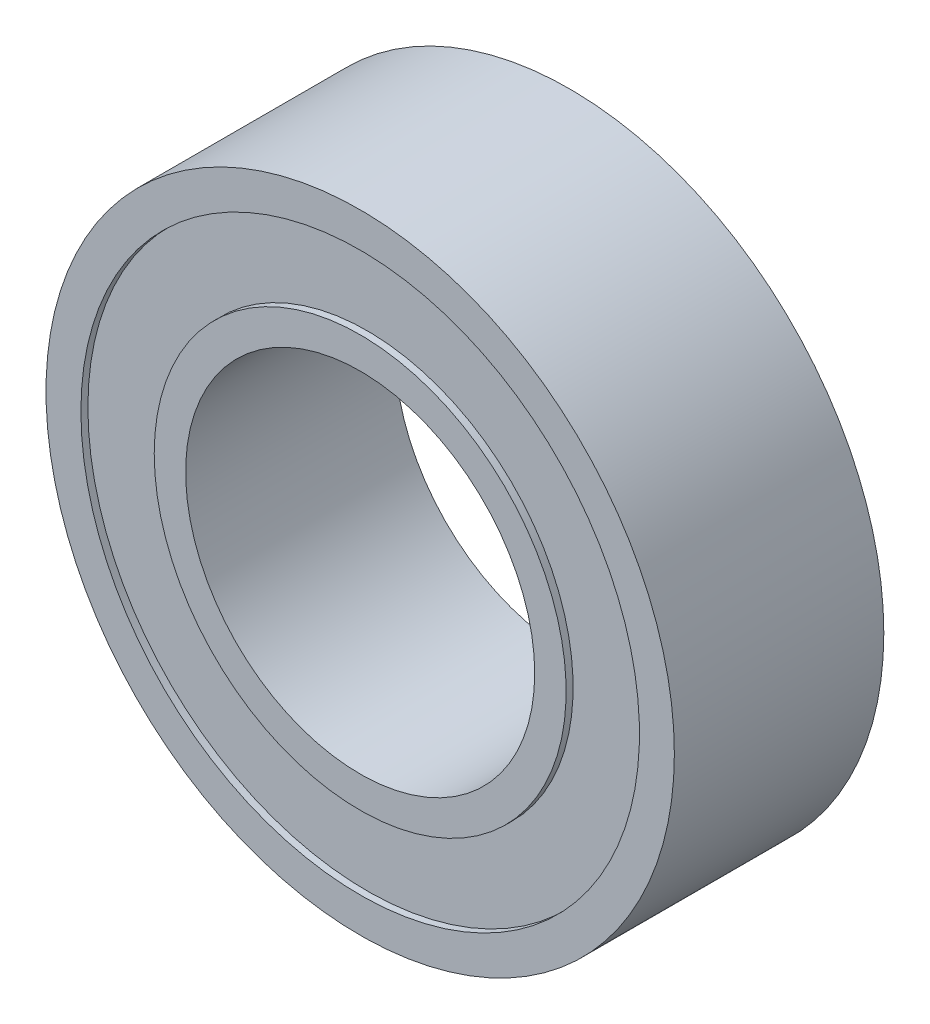
ISO-10303-21;
HEADER;
FILE_DESCRIPTION(('STEP AP214'),'2;1');
FILE_NAME('part.step','',(''),(''),'','','');
FILE_SCHEMA(('AUTOMOTIVE_DESIGN { 1 0 10303 214 1 1 1 1 }'));
ENDSEC;
DATA;
#1=APPLICATION_CONTEXT('core data for automotive mechanical design processes');
#2=APPLICATION_PROTOCOL_DEFINITION('international standard','automotive_design',2000,#1);
#3=PRODUCT_CONTEXT('',#1,'mechanical');
#4=PRODUCT('Part','Part','',(#3));
#5=PRODUCT_RELATED_PRODUCT_CATEGORY('part','',(#4));
#6=PRODUCT_DEFINITION_FORMATION('','',#4);
#7=PRODUCT_DEFINITION_CONTEXT('part definition',#1,'design');
#8=PRODUCT_DEFINITION('design','',#6,#7);
#9=PRODUCT_DEFINITION_SHAPE('','',#8);
#10=(LENGTH_UNIT() NAMED_UNIT(*) SI_UNIT(.MILLI.,.METRE.));
#11=(NAMED_UNIT(*) PLANE_ANGLE_UNIT() SI_UNIT($,.RADIAN.));
#12=(NAMED_UNIT(*) SI_UNIT($,.STERADIAN.) SOLID_ANGLE_UNIT());
#13=UNCERTAINTY_MEASURE_WITH_UNIT(LENGTH_MEASURE(1.E-05),#10,'distance_accuracy_value','');
#14=(GEOMETRIC_REPRESENTATION_CONTEXT(3) GLOBAL_UNCERTAINTY_ASSIGNED_CONTEXT((#13)) GLOBAL_UNIT_ASSIGNED_CONTEXT((#10,
#11,#12)) REPRESENTATION_CONTEXT('',''));
#15=CARTESIAN_POINT('',(0.,0.,0.));
#16=DIRECTION('',(0.,0.,1.));
#17=DIRECTION('',(1.,0.,0.));
#18=AXIS2_PLACEMENT_3D('',#15,#16,#17);
#19=CARTESIAN_POINT('',(0.,0.,0.));
#20=DIRECTION('',(0.,0.,1.));
#21=DIRECTION('',(1.,0.,0.));
#22=AXIS2_PLACEMENT_3D('',#19,#20,#21);
#23=CYLINDRICAL_SURFACE('',#22,2.5);
#24=CARTESIAN_POINT('',(0.,0.,0.));
#25=DIRECTION('',(0.,0.,1.));
#26=DIRECTION('',(1.,0.,0.));
#27=AXIS2_PLACEMENT_3D('',#24,#25,#26);
#28=CIRCLE('',#27,2.5);
#29=CARTESIAN_POINT('',(2.5,0.,0.));
#30=VERTEX_POINT('',#29);
#31=EDGE_CURVE('E51',#30,#30,#28,.F.);
#32=ORIENTED_EDGE('',*,*,#31,.T.);
#33=EDGE_LOOP('',(#32));
#34=FACE_BOUND('',#33,.T.);
#35=CARTESIAN_POINT('',(0.,0.,3.));
#36=DIRECTION('',(0.,0.,1.));
#37=DIRECTION('',(1.,0.,0.));
#38=AXIS2_PLACEMENT_3D('',#35,#36,#37);
#39=CIRCLE('',#38,2.5);
#40=CARTESIAN_POINT('',(2.5,0.,3.));
#41=VERTEX_POINT('',#40);
#42=EDGE_CURVE('E17',#41,#41,#39,.F.);
#43=ORIENTED_EDGE('',*,*,#42,.F.);
#44=EDGE_LOOP('',(#43));
#45=FACE_BOUND('',#44,.T.);
#46=ADVANCED_FACE('F14',(#34,#45),#23,.F.);
#47=CARTESIAN_POINT('',(0.,0.,3.));
#48=DIRECTION('',(0.,0.,1.));
#49=DIRECTION('',(1.,0.,0.));
#50=AXIS2_PLACEMENT_3D('',#47,#48,#49);
#51=PLANE('',#50);
#52=ORIENTED_EDGE('',*,*,#42,.T.);
#53=EDGE_LOOP('',(#52));
#54=FACE_BOUND('',#53,.T.);
#55=CARTESIAN_POINT('',(0.,0.,3.));
#56=DIRECTION('',(0.,0.,-1.));
#57=DIRECTION('',(-1.,0.,0.));
#58=AXIS2_PLACEMENT_3D('',#55,#56,#57);
#59=CIRCLE('',#58,2.95);
#60=CARTESIAN_POINT('',(-2.95,0.,3.));
#61=VERTEX_POINT('',#60);
#62=EDGE_CURVE('E49',#61,#61,#59,.T.);
#63=ORIENTED_EDGE('',*,*,#62,.F.);
#64=EDGE_LOOP('',(#63));
#65=FACE_BOUND('',#64,.T.);
#66=ADVANCED_FACE('F58',(#54,#65),#51,.T.);
#67=CARTESIAN_POINT('',(0.,0.,0.));
#68=DIRECTION('',(0.,0.,1.));
#69=DIRECTION('',(1.,0.,0.));
#70=AXIS2_PLACEMENT_3D('',#67,#68,#69);
#71=PLANE('',#70);
#72=ORIENTED_EDGE('',*,*,#31,.F.);
#73=EDGE_LOOP('',(#72));
#74=FACE_BOUND('',#73,.T.);
#75=CARTESIAN_POINT('',(0.,0.,0.));
#76=DIRECTION('',(0.,0.,1.));
#77=DIRECTION('',(1.,0.,0.));
#78=AXIS2_PLACEMENT_3D('',#75,#76,#77);
#79=CIRCLE('',#78,2.95);
#80=CARTESIAN_POINT('',(2.95,0.,0.));
#81=VERTEX_POINT('',#80);
#82=EDGE_CURVE('E46',#81,#81,#79,.T.);
#83=ORIENTED_EDGE('',*,*,#82,.F.);
#84=EDGE_LOOP('',(#83));
#85=FACE_BOUND('',#84,.T.);
#86=ADVANCED_FACE('F66',(#74,#85),#71,.F.);
#87=CARTESIAN_POINT('',(0.,0.,3.));
#88=DIRECTION('',(0.,0.,-1.));
#89=DIRECTION('',(-1.,0.,0.));
#90=AXIS2_PLACEMENT_3D('',#87,#88,#89);
#91=CYLINDRICAL_SURFACE('',#90,2.95);
#92=ORIENTED_EDGE('',*,*,#62,.T.);
#93=EDGE_LOOP('',(#92));
#94=FACE_BOUND('',#93,.T.);
#95=CARTESIAN_POINT('',(0.,0.,2.9));
#96=DIRECTION('',(0.,0.,-1.));
#97=DIRECTION('',(-1.,0.,0.));
#98=AXIS2_PLACEMENT_3D('',#95,#96,#97);
#99=CIRCLE('',#98,2.95);
#100=CARTESIAN_POINT('',(-2.95,0.,2.9));
#101=VERTEX_POINT('',#100);
#102=EDGE_CURVE('E43',#101,#101,#99,.T.);
#103=ORIENTED_EDGE('',*,*,#102,.F.);
#104=EDGE_LOOP('',(#103));
#105=FACE_BOUND('',#104,.T.);
#106=ADVANCED_FACE('F101',(#94,#105),#91,.T.);
#107=CARTESIAN_POINT('',(0.,0.,0.));
#108=DIRECTION('',(0.,0.,1.));
#109=DIRECTION('',(1.,0.,0.));
#110=AXIS2_PLACEMENT_3D('',#107,#108,#109);
#111=CYLINDRICAL_SURFACE('',#110,2.95);
#112=ORIENTED_EDGE('',*,*,#82,.T.);
#113=EDGE_LOOP('',(#112));
#114=FACE_BOUND('',#113,.T.);
#115=CARTESIAN_POINT('',(0.,0.,0.1));
#116=DIRECTION('',(0.,0.,1.));
#117=DIRECTION('',(1.,0.,0.));
#118=AXIS2_PLACEMENT_3D('',#115,#116,#117);
#119=CIRCLE('',#118,2.95);
#120=CARTESIAN_POINT('',(2.95,0.,0.1));
#121=VERTEX_POINT('',#120);
#122=EDGE_CURVE('E40',#121,#121,#119,.F.);
#123=ORIENTED_EDGE('',*,*,#122,.T.);
#124=EDGE_LOOP('',(#123));
#125=FACE_BOUND('',#124,.T.);
#126=ADVANCED_FACE('F97',(#114,#125),#111,.T.);
#127=CARTESIAN_POINT('',(0.,0.,2.9));
#128=DIRECTION('',(0.,0.,1.));
#129=DIRECTION('',(1.,0.,0.));
#130=AXIS2_PLACEMENT_3D('',#127,#128,#129);
#131=PLANE('',#130);
#132=ORIENTED_EDGE('',*,*,#102,.T.);
#133=EDGE_LOOP('',(#132));
#134=FACE_BOUND('',#133,.T.);
#135=CARTESIAN_POINT('',(0.,0.,2.9));
#136=DIRECTION('',(0.,0.,-1.));
#137=DIRECTION('',(-1.,0.,0.));
#138=AXIS2_PLACEMENT_3D('',#135,#136,#137);
#139=CIRCLE('',#138,4.);
#140=CARTESIAN_POINT('',(-4.,0.,2.9));
#141=VERTEX_POINT('',#140);
#142=EDGE_CURVE('E37',#141,#141,#139,.F.);
#143=ORIENTED_EDGE('',*,*,#142,.T.);
#144=EDGE_LOOP('',(#143));
#145=FACE_BOUND('',#144,.T.);
#146=ADVANCED_FACE('F93',(#134,#145),#131,.T.);
#147=CARTESIAN_POINT('',(0.,0.,0.1));
#148=DIRECTION('',(0.,0.,1.));
#149=DIRECTION('',(1.,0.,0.));
#150=AXIS2_PLACEMENT_3D('',#147,#148,#149);
#151=PLANE('',#150);
#152=ORIENTED_EDGE('',*,*,#122,.F.);
#153=EDGE_LOOP('',(#152));
#154=FACE_BOUND('',#153,.T.);
#155=CARTESIAN_POINT('',(0.,0.,0.1));
#156=DIRECTION('',(0.,0.,1.));
#157=DIRECTION('',(1.,0.,0.));
#158=AXIS2_PLACEMENT_3D('',#155,#156,#157);
#159=CIRCLE('',#158,4.);
#160=CARTESIAN_POINT('',(4.,0.,0.1));
#161=VERTEX_POINT('',#160);
#162=EDGE_CURVE('E34',#161,#161,#159,.F.);
#163=ORIENTED_EDGE('',*,*,#162,.T.);
#164=EDGE_LOOP('',(#163));
#165=FACE_BOUND('',#164,.T.);
#166=ADVANCED_FACE('F89',(#154,#165),#151,.F.);
#167=CARTESIAN_POINT('',(0.,0.,3.));
#168=DIRECTION('',(0.,0.,-1.));
#169=DIRECTION('',(-1.,0.,0.));
#170=AXIS2_PLACEMENT_3D('',#167,#168,#169);
#171=CYLINDRICAL_SURFACE('',#170,4.);
#172=CARTESIAN_POINT('',(0.,0.,3.));
#173=DIRECTION('',(0.,0.,-1.));
#174=DIRECTION('',(-1.,0.,0.));
#175=AXIS2_PLACEMENT_3D('',#172,#173,#174);
#176=CIRCLE('',#175,4.);
#177=CARTESIAN_POINT('',(-4.,0.,3.));
#178=VERTEX_POINT('',#177);
#179=EDGE_CURVE('E31',#178,#178,#176,.T.);
#180=ORIENTED_EDGE('',*,*,#179,.F.);
#181=EDGE_LOOP('',(#180));
#182=FACE_BOUND('',#181,.T.);
#183=ORIENTED_EDGE('',*,*,#142,.F.);
#184=EDGE_LOOP('',(#183));
#185=FACE_BOUND('',#184,.T.);
#186=ADVANCED_FACE('F85',(#182,#185),#171,.F.);
#187=CARTESIAN_POINT('',(0.,0.,0.));
#188=DIRECTION('',(0.,0.,1.));
#189=DIRECTION('',(1.,0.,0.));
#190=AXIS2_PLACEMENT_3D('',#187,#188,#189);
#191=CYLINDRICAL_SURFACE('',#190,4.);
#192=CARTESIAN_POINT('',(0.,0.,0.));
#193=DIRECTION('',(0.,0.,1.));
#194=DIRECTION('',(1.,0.,0.));
#195=AXIS2_PLACEMENT_3D('',#192,#193,#194);
#196=CIRCLE('',#195,4.);
#197=CARTESIAN_POINT('',(4.,0.,0.));
#198=VERTEX_POINT('',#197);
#199=EDGE_CURVE('E26',#198,#198,#196,.F.);
#200=ORIENTED_EDGE('',*,*,#199,.T.);
#201=EDGE_LOOP('',(#200));
#202=FACE_BOUND('',#201,.T.);
#203=ORIENTED_EDGE('',*,*,#162,.F.);
#204=EDGE_LOOP('',(#203));
#205=FACE_BOUND('',#204,.T.);
#206=ADVANCED_FACE('F81',(#202,#205),#191,.F.);
#207=CARTESIAN_POINT('',(0.,0.,3.));
#208=DIRECTION('',(0.,0.,1.));
#209=DIRECTION('',(1.,0.,0.));
#210=AXIS2_PLACEMENT_3D('',#207,#208,#209);
#211=PLANE('',#210);
#212=ORIENTED_EDGE('',*,*,#179,.T.);
#213=EDGE_LOOP('',(#212));
#214=FACE_BOUND('',#213,.T.);
#215=CARTESIAN_POINT('',(0.,0.,3.));
#216=DIRECTION('',(0.,0.,1.));
#217=DIRECTION('',(1.,0.,0.));
#218=AXIS2_PLACEMENT_3D('',#215,#216,#217);
#219=CIRCLE('',#218,4.5);
#220=CARTESIAN_POINT('',(4.5,0.,3.));
#221=VERTEX_POINT('',#220);
#222=EDGE_CURVE('E21',#221,#221,#219,.F.);
#223=ORIENTED_EDGE('',*,*,#222,.F.);
#224=EDGE_LOOP('',(#223));
#225=FACE_BOUND('',#224,.T.);
#226=ADVANCED_FACE('F74',(#214,#225),#211,.T.);
#227=CARTESIAN_POINT('',(0.,0.,0.));
#228=DIRECTION('',(0.,0.,1.));
#229=DIRECTION('',(1.,0.,0.));
#230=AXIS2_PLACEMENT_3D('',#227,#228,#229);
#231=PLANE('',#230);
#232=ORIENTED_EDGE('',*,*,#199,.F.);
#233=EDGE_LOOP('',(#232));
#234=FACE_BOUND('',#233,.T.);
#235=CARTESIAN_POINT('',(0.,0.,0.));
#236=DIRECTION('',(0.,0.,1.));
#237=DIRECTION('',(1.,0.,0.));
#238=AXIS2_PLACEMENT_3D('',#235,#236,#237);
#239=CIRCLE('',#238,4.5);
#240=CARTESIAN_POINT('',(4.5,0.,0.));
#241=VERTEX_POINT('',#240);
#242=EDGE_CURVE('E10',#241,#241,#239,.T.);
#243=ORIENTED_EDGE('',*,*,#242,.F.);
#244=EDGE_LOOP('',(#243));
#245=FACE_BOUND('',#244,.T.);
#246=ADVANCED_FACE('F69',(#234,#245),#231,.F.);
#247=CARTESIAN_POINT('',(0.,0.,0.));
#248=DIRECTION('',(0.,0.,1.));
#249=DIRECTION('',(1.,0.,0.));
#250=AXIS2_PLACEMENT_3D('',#247,#248,#249);
#251=CYLINDRICAL_SURFACE('',#250,4.5);
#252=ORIENTED_EDGE('',*,*,#242,.T.);
#253=EDGE_LOOP('',(#252));
#254=FACE_BOUND('',#253,.T.);
#255=ORIENTED_EDGE('',*,*,#222,.T.);
#256=EDGE_LOOP('',(#255));
#257=FACE_BOUND('',#256,.T.);
#258=ADVANCED_FACE('F67',(#254,#257),#251,.T.);
#259=CLOSED_SHELL('',(#46,#66,#86,#106,#126,#146,#166,#186,#206,#226,#246,#258));
#260=MANIFOLD_SOLID_BREP('B1',#259);
#261=ADVANCED_BREP_SHAPE_REPRESENTATION('',(#18,#260),#14);
#262=SHAPE_DEFINITION_REPRESENTATION(#9,#261);
ENDSEC;
END-ISO-10303-21;
